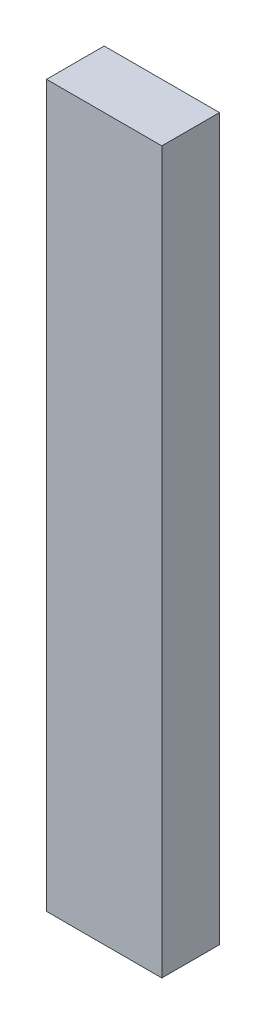
ISO-10303-21;
HEADER;
FILE_DESCRIPTION(('STEP AP214'),'2;1');
FILE_NAME('part.step','',(''),(''),'','','');
FILE_SCHEMA(('AUTOMOTIVE_DESIGN { 1 0 10303 214 1 1 1 1 }'));
ENDSEC;
DATA;
#1=APPLICATION_CONTEXT('core data for automotive mechanical design processes');
#2=APPLICATION_PROTOCOL_DEFINITION('international standard','automotive_design',2000,#1);
#3=PRODUCT_CONTEXT('',#1,'mechanical');
#4=PRODUCT('Part','Part','',(#3));
#5=PRODUCT_RELATED_PRODUCT_CATEGORY('part','',(#4));
#6=PRODUCT_DEFINITION_FORMATION('','',#4);
#7=PRODUCT_DEFINITION_CONTEXT('part definition',#1,'design');
#8=PRODUCT_DEFINITION('design','',#6,#7);
#9=PRODUCT_DEFINITION_SHAPE('','',#8);
#10=(LENGTH_UNIT() NAMED_UNIT(*) SI_UNIT(.MILLI.,.METRE.));
#11=(NAMED_UNIT(*) PLANE_ANGLE_UNIT() SI_UNIT($,.RADIAN.));
#12=(NAMED_UNIT(*) SI_UNIT($,.STERADIAN.) SOLID_ANGLE_UNIT());
#13=UNCERTAINTY_MEASURE_WITH_UNIT(LENGTH_MEASURE(1.E-05),#10,'distance_accuracy_value','');
#14=(GEOMETRIC_REPRESENTATION_CONTEXT(3) GLOBAL_UNCERTAINTY_ASSIGNED_CONTEXT((#13)) GLOBAL_UNIT_ASSIGNED_CONTEXT((#10,
#11,#12)) REPRESENTATION_CONTEXT('',''));
#15=CARTESIAN_POINT('',(0.,0.,0.));
#16=DIRECTION('',(0.,0.,1.));
#17=DIRECTION('',(1.,0.,0.));
#18=AXIS2_PLACEMENT_3D('',#15,#16,#17);
#19=CARTESIAN_POINT('',(0.,0.,25.4000000000001));
#20=DIRECTION('',(1.,0.,0.));
#21=DIRECTION('',(0.,0.,-1.));
#22=AXIS2_PLACEMENT_3D('',#19,#20,#21);
#23=PLANE('',#22);
#24=DIRECTION('',(0.,-1.,0.));
#25=VECTOR('',#24,1.);
#26=CARTESIAN_POINT('',(0.,0.,0.));
#27=LINE('',#26,#25);
#28=CARTESIAN_POINT('',(0.,317.5,0.));
#29=VERTEX_POINT('',#28);
#30=CARTESIAN_POINT('',(0.,0.,0.));
#31=VERTEX_POINT('',#30);
#32=EDGE_CURVE('E97',#29,#31,#27,.T.);
#33=ORIENTED_EDGE('',*,*,#32,.T.);
#34=DIRECTION('',(0.,0.,-1.));
#35=VECTOR('',#34,1.);
#36=CARTESIAN_POINT('',(0.,0.,25.4000000000001));
#37=LINE('',#36,#35);
#38=CARTESIAN_POINT('',(0.,0.,25.4000000000001));
#39=VERTEX_POINT('',#38);
#40=EDGE_CURVE('E11',#39,#31,#37,.T.);
#41=ORIENTED_EDGE('',*,*,#40,.F.);
#42=DIRECTION('',(0.,-1.,0.));
#43=VECTOR('',#42,1.);
#44=CARTESIAN_POINT('',(0.,0.,25.4000000000001));
#45=LINE('',#44,#43);
#46=CARTESIAN_POINT('',(0.,317.5,25.4000000000001));
#47=VERTEX_POINT('',#46);
#48=EDGE_CURVE('E85',#47,#39,#45,.T.);
#49=ORIENTED_EDGE('',*,*,#48,.F.);
#50=DIRECTION('',(0.,0.,-1.));
#51=VECTOR('',#50,1.);
#52=CARTESIAN_POINT('',(0.,317.5,25.4000000000001));
#53=LINE('',#52,#51);
#54=EDGE_CURVE('E93',#47,#29,#53,.T.);
#55=ORIENTED_EDGE('',*,*,#54,.T.);
#56=EDGE_LOOP('',(#33,#41,#49,#55));
#57=FACE_BOUND('',#56,.T.);
#58=ADVANCED_FACE('F34',(#57),#23,.F.);
#59=CARTESIAN_POINT('',(0.,0.,25.4000000000001));
#60=DIRECTION('',(0.,1.,0.));
#61=DIRECTION('',(0.,0.,1.));
#62=AXIS2_PLACEMENT_3D('',#59,#60,#61);
#63=PLANE('',#62);
#64=DIRECTION('',(1.,0.,0.));
#65=VECTOR('',#64,1.);
#66=CARTESIAN_POINT('',(0.,0.,0.));
#67=LINE('',#66,#65);
#68=CARTESIAN_POINT('',(50.8,0.,0.));
#69=VERTEX_POINT('',#68);
#70=EDGE_CURVE('E89',#31,#69,#67,.T.);
#71=ORIENTED_EDGE('',*,*,#70,.T.);
#72=DIRECTION('',(0.,0.,-1.));
#73=VECTOR('',#72,1.);
#74=CARTESIAN_POINT('',(50.8,0.,25.4000000000001));
#75=LINE('',#74,#73);
#76=CARTESIAN_POINT('',(50.8,0.,25.4000000000001));
#77=VERTEX_POINT('',#76);
#78=EDGE_CURVE('E42',#77,#69,#75,.T.);
#79=ORIENTED_EDGE('',*,*,#78,.F.);
#80=DIRECTION('',(1.,0.,0.));
#81=VECTOR('',#80,1.);
#82=CARTESIAN_POINT('',(0.,0.,25.4000000000001));
#83=LINE('',#82,#81);
#84=EDGE_CURVE('E80',#39,#77,#83,.T.);
#85=ORIENTED_EDGE('',*,*,#84,.F.);
#86=ORIENTED_EDGE('',*,*,#40,.T.);
#87=EDGE_LOOP('',(#71,#79,#85,#86));
#88=FACE_BOUND('',#87,.T.);
#89=ADVANCED_FACE('F88',(#88),#63,.F.);
#90=CARTESIAN_POINT('',(50.8,0.,25.4000000000001));
#91=DIRECTION('',(-1.,0.,0.));
#92=DIRECTION('',(0.,0.,1.));
#93=AXIS2_PLACEMENT_3D('',#90,#91,#92);
#94=PLANE('',#93);
#95=DIRECTION('',(0.,1.,0.));
#96=VECTOR('',#95,1.);
#97=CARTESIAN_POINT('',(50.8,0.,0.));
#98=LINE('',#97,#96);
#99=CARTESIAN_POINT('',(50.8,317.5,0.));
#100=VERTEX_POINT('',#99);
#101=EDGE_CURVE('E67',#69,#100,#98,.T.);
#102=ORIENTED_EDGE('',*,*,#101,.T.);
#103=DIRECTION('',(0.,0.,-1.));
#104=VECTOR('',#103,1.);
#105=CARTESIAN_POINT('',(50.8,317.5,25.4000000000001));
#106=LINE('',#105,#104);
#107=CARTESIAN_POINT('',(50.8,317.5,25.4000000000001));
#108=VERTEX_POINT('',#107);
#109=EDGE_CURVE('E90',#108,#100,#106,.T.);
#110=ORIENTED_EDGE('',*,*,#109,.F.);
#111=DIRECTION('',(0.,1.,0.));
#112=VECTOR('',#111,1.);
#113=CARTESIAN_POINT('',(50.8,0.,25.4000000000001));
#114=LINE('',#113,#112);
#115=EDGE_CURVE('E83',#77,#108,#114,.T.);
#116=ORIENTED_EDGE('',*,*,#115,.F.);
#117=ORIENTED_EDGE('',*,*,#78,.T.);
#118=EDGE_LOOP('',(#102,#110,#116,#117));
#119=FACE_BOUND('',#118,.T.);
#120=ADVANCED_FACE('F91',(#119),#94,.F.);
#121=CARTESIAN_POINT('',(0.,317.5,25.4000000000001));
#122=DIRECTION('',(0.,-1.,0.));
#123=DIRECTION('',(0.,0.,-1.));
#124=AXIS2_PLACEMENT_3D('',#121,#122,#123);
#125=PLANE('',#124);
#126=DIRECTION('',(-1.,0.,0.));
#127=VECTOR('',#126,1.);
#128=CARTESIAN_POINT('',(0.,317.5,0.));
#129=LINE('',#128,#127);
#130=EDGE_CURVE('E73',#100,#29,#129,.T.);
#131=ORIENTED_EDGE('',*,*,#130,.T.);
#132=ORIENTED_EDGE('',*,*,#54,.F.);
#133=DIRECTION('',(-1.,0.,0.));
#134=VECTOR('',#133,1.);
#135=CARTESIAN_POINT('',(0.,317.5,25.4000000000001));
#136=LINE('',#135,#134);
#137=EDGE_CURVE('E50',#108,#47,#136,.T.);
#138=ORIENTED_EDGE('',*,*,#137,.F.);
#139=ORIENTED_EDGE('',*,*,#109,.T.);
#140=EDGE_LOOP('',(#131,#132,#138,#139));
#141=FACE_BOUND('',#140,.T.);
#142=ADVANCED_FACE('F104',(#141),#125,.F.);
#143=CARTESIAN_POINT('',(0.,0.,25.4000000000001));
#144=DIRECTION('',(0.,0.,-1.));
#145=DIRECTION('',(-1.,0.,0.));
#146=AXIS2_PLACEMENT_3D('',#143,#144,#145);
#147=PLANE('',#146);
#148=ORIENTED_EDGE('',*,*,#48,.T.);
#149=ORIENTED_EDGE('',*,*,#84,.T.);
#150=ORIENTED_EDGE('',*,*,#115,.T.);
#151=ORIENTED_EDGE('',*,*,#137,.T.);
#152=EDGE_LOOP('',(#148,#149,#150,#151));
#153=FACE_BOUND('',#152,.T.);
#154=ADVANCED_FACE('F81',(#153),#147,.F.);
#155=CARTESIAN_POINT('',(0.,0.,0.));
#156=DIRECTION('',(0.,0.,-1.));
#157=DIRECTION('',(-1.,0.,0.));
#158=AXIS2_PLACEMENT_3D('',#155,#156,#157);
#159=PLANE('',#158);
#160=ORIENTED_EDGE('',*,*,#32,.F.);
#161=ORIENTED_EDGE('',*,*,#130,.F.);
#162=ORIENTED_EDGE('',*,*,#101,.F.);
#163=ORIENTED_EDGE('',*,*,#70,.F.);
#164=EDGE_LOOP('',(#160,#161,#162,#163));
#165=FACE_BOUND('',#164,.T.);
#166=ADVANCED_FACE('F107',(#165),#159,.T.);
#167=CLOSED_SHELL('',(#58,#89,#120,#142,#154,#166));
#168=MANIFOLD_SOLID_BREP('B2',#167);
#169=ADVANCED_BREP_SHAPE_REPRESENTATION('',(#18,#168),#14);
#170=SHAPE_DEFINITION_REPRESENTATION(#9,#169);
ENDSEC;
END-ISO-10303-21;
